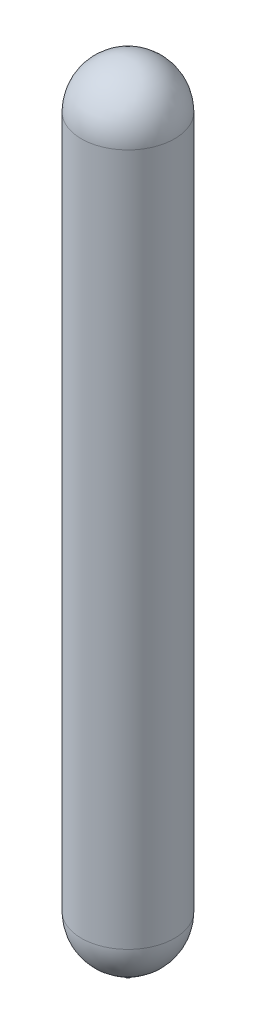
ISO-10303-21;
HEADER;
FILE_DESCRIPTION(('STEP AP214'),'2;1');
FILE_NAME('part.step','',(''),(''),'','','');
FILE_SCHEMA(('AUTOMOTIVE_DESIGN { 1 0 10303 214 1 1 1 1 }'));
ENDSEC;
DATA;
#1=APPLICATION_CONTEXT('core data for automotive mechanical design processes');
#2=APPLICATION_PROTOCOL_DEFINITION('international standard','automotive_design',2000,#1);
#3=PRODUCT_CONTEXT('',#1,'mechanical');
#4=PRODUCT('Part','Part','',(#3));
#5=PRODUCT_RELATED_PRODUCT_CATEGORY('part','',(#4));
#6=PRODUCT_DEFINITION_FORMATION('','',#4);
#7=PRODUCT_DEFINITION_CONTEXT('part definition',#1,'design');
#8=PRODUCT_DEFINITION('design','',#6,#7);
#9=PRODUCT_DEFINITION_SHAPE('','',#8);
#10=(LENGTH_UNIT() NAMED_UNIT(*) SI_UNIT(.MILLI.,.METRE.));
#11=(NAMED_UNIT(*) PLANE_ANGLE_UNIT() SI_UNIT($,.RADIAN.));
#12=(NAMED_UNIT(*) SI_UNIT($,.STERADIAN.) SOLID_ANGLE_UNIT());
#13=UNCERTAINTY_MEASURE_WITH_UNIT(LENGTH_MEASURE(1.E-05),#10,'distance_accuracy_value','');
#14=(GEOMETRIC_REPRESENTATION_CONTEXT(3) GLOBAL_UNCERTAINTY_ASSIGNED_CONTEXT((#13)) GLOBAL_UNIT_ASSIGNED_CONTEXT((#10,
#11,#12)) REPRESENTATION_CONTEXT('',''));
#15=CARTESIAN_POINT('',(0.,0.,0.));
#16=DIRECTION('',(0.,0.,1.));
#17=DIRECTION('',(1.,0.,0.));
#18=AXIS2_PLACEMENT_3D('',#15,#16,#17);
#19=CARTESIAN_POINT('',(0.,50.3580155806544,0.));
#20=DIRECTION('',(0.,1.,0.));
#21=DIRECTION('',(-1.,0.,0.));
#22=AXIS2_PLACEMENT_3D('',#19,#20,#21);
#23=CYLINDRICAL_SURFACE('',#22,142.2146);
#24=CARTESIAN_POINT('',(-2.52480794608641E-13,2112.02016,0.));
#25=DIRECTION('',(0.,1.,0.));
#26=DIRECTION('',(-1.,0.,0.));
#27=AXIS2_PLACEMENT_3D('',#24,#25,#26);
#28=CIRCLE('',#27,142.2146);
#29=CARTESIAN_POINT('',(-142.2146,2112.02016,0.));
#30=VERTEX_POINT('',#29);
#31=EDGE_CURVE('E68',#30,#30,#28,.T.);
#32=ORIENTED_EDGE('',*,*,#31,.F.);
#33=EDGE_LOOP('',(#32));
#34=FACE_BOUND('',#33,.T.);
#35=CARTESIAN_POINT('',(0.,0.,0.));
#36=DIRECTION('',(0.,1.,0.));
#37=DIRECTION('',(-1.,0.,0.));
#38=AXIS2_PLACEMENT_3D('',#35,#36,#37);
#39=CIRCLE('',#38,142.2146);
#40=CARTESIAN_POINT('',(-142.2146,0.,0.));
#41=VERTEX_POINT('',#40);
#42=EDGE_CURVE('E11',#41,#41,#39,.T.);
#43=ORIENTED_EDGE('',*,*,#42,.T.);
#44=EDGE_LOOP('',(#43));
#45=FACE_BOUND('',#44,.T.);
#46=ADVANCED_FACE('F46',(#34,#45),#23,.T.);
#47=CARTESIAN_POINT('',(0.,0.,0.));
#48=DIRECTION('',(0.,1.,0.));
#49=DIRECTION('',(-1.,0.,0.));
#50=AXIS2_PLACEMENT_3D('',#47,#48,#49);
#51=SPHERICAL_SURFACE('',#50,142.2146);
#52=CARTESIAN_POINT('',(0.,-141.646399365321,0.));
#53=DIRECTION('',(0.,1.,0.));
#54=DIRECTION('',(-1.,0.,0.));
#55=AXIS2_PLACEMENT_3D('',#52,#53,#54);
#56=CIRCLE('',#55,12.7);
#57=CARTESIAN_POINT('',(-12.7,-141.646399365321,0.));
#58=VERTEX_POINT('',#57);
#59=EDGE_CURVE('E52',#58,#58,#56,.T.);
#60=ORIENTED_EDGE('',*,*,#59,.T.);
#61=EDGE_LOOP('',(#60));
#62=FACE_BOUND('',#61,.T.);
#63=ORIENTED_EDGE('',*,*,#42,.F.);
#64=EDGE_LOOP('',(#63));
#65=FACE_BOUND('',#64,.T.);
#66=ADVANCED_FACE('F75',(#62,#65),#51,.T.);
#67=CARTESIAN_POINT('',(0.,50.3580155806544,0.));
#68=DIRECTION('',(0.,1.,0.));
#69=DIRECTION('',(-1.,0.,0.));
#70=AXIS2_PLACEMENT_3D('',#67,#68,#69);
#71=CYLINDRICAL_SURFACE('',#70,12.7);
#72=CARTESIAN_POINT('',(0.,-138.305330063017,0.));
#73=DIRECTION('',(0.,1.,0.));
#74=DIRECTION('',(-1.,0.,0.));
#75=AXIS2_PLACEMENT_3D('',#72,#73,#74);
#76=CIRCLE('',#75,12.7);
#77=CARTESIAN_POINT('',(-12.7,-138.305330063017,0.));
#78=VERTEX_POINT('',#77);
#79=EDGE_CURVE('E56',#78,#78,#76,.T.);
#80=ORIENTED_EDGE('',*,*,#79,.T.);
#81=EDGE_LOOP('',(#80));
#82=FACE_BOUND('',#81,.T.);
#83=ORIENTED_EDGE('',*,*,#59,.F.);
#84=EDGE_LOOP('',(#83));
#85=FACE_BOUND('',#84,.T.);
#86=ADVANCED_FACE('F79',(#82,#85),#71,.F.);
#87=CARTESIAN_POINT('',(0.,0.,0.));
#88=DIRECTION('',(0.,1.,0.));
#89=DIRECTION('',(-1.,0.,0.));
#90=AXIS2_PLACEMENT_3D('',#87,#88,#89);
#91=SPHERICAL_SURFACE('',#90,138.8872);
#92=ORIENTED_EDGE('',*,*,#79,.F.);
#93=EDGE_LOOP('',(#92));
#94=FACE_BOUND('',#93,.T.);
#95=CARTESIAN_POINT('',(0.,0.,0.));
#96=DIRECTION('',(0.,1.,0.));
#97=DIRECTION('',(-1.,0.,0.));
#98=AXIS2_PLACEMENT_3D('',#95,#96,#97);
#99=CIRCLE('',#98,138.8872);
#100=CARTESIAN_POINT('',(-138.8872,0.,0.));
#101=VERTEX_POINT('',#100);
#102=EDGE_CURVE('E60',#101,#101,#99,.T.);
#103=ORIENTED_EDGE('',*,*,#102,.T.);
#104=EDGE_LOOP('',(#103));
#105=FACE_BOUND('',#104,.T.);
#106=ADVANCED_FACE('F83',(#94,#105),#91,.F.);
#107=CARTESIAN_POINT('',(0.,50.3580155806544,0.));
#108=DIRECTION('',(0.,1.,0.));
#109=DIRECTION('',(-1.,0.,0.));
#110=AXIS2_PLACEMENT_3D('',#107,#108,#109);
#111=CYLINDRICAL_SURFACE('',#110,138.8872);
#112=ORIENTED_EDGE('',*,*,#102,.F.);
#113=EDGE_LOOP('',(#112));
#114=FACE_BOUND('',#113,.T.);
#115=CARTESIAN_POINT('',(-2.52480794608641E-13,2112.02016,0.));
#116=DIRECTION('',(0.,1.,0.));
#117=DIRECTION('',(-1.,0.,0.));
#118=AXIS2_PLACEMENT_3D('',#115,#116,#117);
#119=CIRCLE('',#118,138.8872);
#120=CARTESIAN_POINT('',(-138.8872,2112.02016,0.));
#121=VERTEX_POINT('',#120);
#122=EDGE_CURVE('E65',#121,#121,#119,.T.);
#123=ORIENTED_EDGE('',*,*,#122,.T.);
#124=EDGE_LOOP('',(#123));
#125=FACE_BOUND('',#124,.T.);
#126=ADVANCED_FACE('F90',(#114,#125),#111,.F.);
#127=CARTESIAN_POINT('',(-2.4980018054066E-13,2112.02016,0.));
#128=DIRECTION('',(0.,1.,0.));
#129=DIRECTION('',(-1.,0.,0.));
#130=AXIS2_PLACEMENT_3D('',#127,#128,#129);
#131=SPHERICAL_SURFACE('',#130,138.887199999999);
#132=ORIENTED_EDGE('',*,*,#122,.F.);
#133=EDGE_LOOP('',(#132));
#134=FACE_BOUND('',#133,.T.);
#135=ADVANCED_FACE('F94',(#134),#131,.F.);
#136=CARTESIAN_POINT('',(-2.4980018054066E-13,2112.02016,0.));
#137=DIRECTION('',(0.,1.,0.));
#138=DIRECTION('',(-1.,0.,0.));
#139=AXIS2_PLACEMENT_3D('',#136,#137,#138);
#140=SPHERICAL_SURFACE('',#139,142.2146);
#141=ORIENTED_EDGE('',*,*,#31,.T.);
#142=EDGE_LOOP('',(#141));
#143=FACE_BOUND('',#142,.T.);
#144=ADVANCED_FACE('F72',(#143),#140,.T.);
#145=CLOSED_SHELL('',(#46,#66,#86,#106,#126,#135,#144));
#146=MANIFOLD_SOLID_BREP('B2',#145);
#147=CARTESIAN_POINT('',(0.,50.3580155806544,0.));
#148=DIRECTION('',(0.,1.,0.));
#149=DIRECTION('',(-1.,0.,0.));
#150=AXIS2_PLACEMENT_3D('',#147,#148,#149);
#151=CYLINDRICAL_SURFACE('',#150,138.8872);
#152=CARTESIAN_POINT('',(0.,0.,0.));
#153=DIRECTION('',(0.,1.,0.));
#154=DIRECTION('',(-1.,0.,0.));
#155=AXIS2_PLACEMENT_3D('',#152,#153,#154);
#156=CIRCLE('',#155,138.8872);
#157=CARTESIAN_POINT('',(-138.8872,0.,0.));
#158=VERTEX_POINT('',#157);
#159=EDGE_CURVE('E45',#158,#158,#156,.T.);
#160=ORIENTED_EDGE('',*,*,#159,.T.);
#161=EDGE_LOOP('',(#160));
#162=FACE_BOUND('',#161,.T.);
#163=CARTESIAN_POINT('',(-2.52480794608641E-13,2112.02016,0.));
#164=DIRECTION('',(0.,1.,0.));
#165=DIRECTION('',(-1.,0.,0.));
#166=AXIS2_PLACEMENT_3D('',#163,#164,#165);
#167=CIRCLE('',#166,138.8872);
#168=CARTESIAN_POINT('',(-138.8872,2112.02016,0.));
#169=VERTEX_POINT('',#168);
#170=EDGE_CURVE('E174',#169,#169,#167,.T.);
#171=ORIENTED_EDGE('',*,*,#170,.F.);
#172=EDGE_LOOP('',(#171));
#173=FACE_BOUND('',#172,.T.);
#174=ADVANCED_FACE('F146',(#162,#173),#151,.T.);
#175=CARTESIAN_POINT('',(0.,0.,0.));
#176=DIRECTION('',(0.,1.,0.));
#177=DIRECTION('',(-1.,0.,0.));
#178=AXIS2_PLACEMENT_3D('',#175,#176,#177);
#179=SPHERICAL_SURFACE('',#178,138.8872);
#180=CARTESIAN_POINT('',(0.,-138.305330063017,0.));
#181=DIRECTION('',(0.,1.,0.));
#182=DIRECTION('',(-1.,0.,0.));
#183=AXIS2_PLACEMENT_3D('',#180,#181,#182);
#184=CIRCLE('',#183,12.7);
#185=CARTESIAN_POINT('',(-12.7,-138.305330063017,0.));
#186=VERTEX_POINT('',#185);
#187=EDGE_CURVE('E152',#186,#186,#184,.T.);
#188=ORIENTED_EDGE('',*,*,#187,.T.);
#189=EDGE_LOOP('',(#188));
#190=FACE_BOUND('',#189,.T.);
#191=ORIENTED_EDGE('',*,*,#159,.F.);
#192=EDGE_LOOP('',(#191));
#193=FACE_BOUND('',#192,.T.);
#194=ADVANCED_FACE('F181',(#190,#193),#179,.T.);
#195=CARTESIAN_POINT('',(0.,50.3580155806544,0.));
#196=DIRECTION('',(0.,1.,0.));
#197=DIRECTION('',(-1.,0.,0.));
#198=AXIS2_PLACEMENT_3D('',#195,#196,#197);
#199=CYLINDRICAL_SURFACE('',#198,12.7);
#200=ORIENTED_EDGE('',*,*,#187,.F.);
#201=EDGE_LOOP('',(#200));
#202=FACE_BOUND('',#201,.T.);
#203=CARTESIAN_POINT('',(0.,-167.046399365321,0.));
#204=DIRECTION('',(0.,1.,0.));
#205=DIRECTION('',(-1.,0.,0.));
#206=AXIS2_PLACEMENT_3D('',#203,#204,#205);
#207=CIRCLE('',#206,12.7);
#208=CARTESIAN_POINT('',(-12.7,-167.046399365321,0.));
#209=VERTEX_POINT('',#208);
#210=EDGE_CURVE('E156',#209,#209,#207,.T.);
#211=ORIENTED_EDGE('',*,*,#210,.T.);
#212=EDGE_LOOP('',(#211));
#213=FACE_BOUND('',#212,.T.);
#214=ADVANCED_FACE('F185',(#202,#213),#199,.T.);
#215=CARTESIAN_POINT('',(0.,-167.046399365321,0.));
#216=DIRECTION('',(0.,1.,0.));
#217=DIRECTION('',(-1.,0.,0.));
#218=AXIS2_PLACEMENT_3D('',#215,#216,#217);
#219=PLANE('',#218);
#220=ORIENTED_EDGE('',*,*,#210,.F.);
#221=EDGE_LOOP('',(#220));
#222=FACE_BOUND('',#221,.T.);
#223=CARTESIAN_POINT('',(0.,-167.046399365321,0.));
#224=DIRECTION('',(0.,1.,0.));
#225=DIRECTION('',(-1.,0.,0.));
#226=AXIS2_PLACEMENT_3D('',#223,#224,#225);
#227=CIRCLE('',#226,3.175);
#228=CARTESIAN_POINT('',(-3.17499999999997,-167.046399365321,0.));
#229=VERTEX_POINT('',#228);
#230=EDGE_CURVE('E160',#229,#229,#227,.T.);
#231=ORIENTED_EDGE('',*,*,#230,.T.);
#232=EDGE_LOOP('',(#231));
#233=FACE_BOUND('',#232,.T.);
#234=ADVANCED_FACE('F189',(#222,#233),#219,.F.);
#235=CARTESIAN_POINT('',(0.,50.3580155806544,0.));
#236=DIRECTION('',(0.,1.,0.));
#237=DIRECTION('',(-1.,0.,0.));
#238=AXIS2_PLACEMENT_3D('',#235,#236,#237);
#239=CYLINDRICAL_SURFACE('',#238,3.175);
#240=ORIENTED_EDGE('',*,*,#230,.F.);
#241=EDGE_LOOP('',(#240));
#242=FACE_BOUND('',#241,.T.);
#243=CARTESIAN_POINT('',(0.,-117.000128381297,0.));
#244=DIRECTION('',(0.,1.,0.));
#245=DIRECTION('',(-1.,0.,0.));
#246=AXIS2_PLACEMENT_3D('',#243,#244,#245);
#247=CIRCLE('',#246,3.175);
#248=CARTESIAN_POINT('',(-3.17499999999998,-117.000128381297,0.));
#249=VERTEX_POINT('',#248);
#250=EDGE_CURVE('E165',#249,#249,#247,.T.);
#251=ORIENTED_EDGE('',*,*,#250,.T.);
#252=EDGE_LOOP('',(#251));
#253=FACE_BOUND('',#252,.T.);
#254=ADVANCED_FACE('F196',(#242,#253),#239,.F.);
#255=CARTESIAN_POINT('',(0.,0.,0.));
#256=DIRECTION('',(0.,1.,0.));
#257=DIRECTION('',(-1.,0.,0.));
#258=AXIS2_PLACEMENT_3D('',#255,#256,#257);
#259=SPHERICAL_SURFACE('',#258,117.0432);
#260=ORIENTED_EDGE('',*,*,#250,.F.);
#261=EDGE_LOOP('',(#260));
#262=FACE_BOUND('',#261,.T.);
#263=CARTESIAN_POINT('',(0.,0.,0.));
#264=DIRECTION('',(0.,1.,0.));
#265=DIRECTION('',(-1.,0.,0.));
#266=AXIS2_PLACEMENT_3D('',#263,#264,#265);
#267=CIRCLE('',#266,117.0432);
#268=CARTESIAN_POINT('',(-117.0432,0.,0.));
#269=VERTEX_POINT('',#268);
#270=EDGE_CURVE('E168',#269,#269,#267,.T.);
#271=ORIENTED_EDGE('',*,*,#270,.T.);
#272=EDGE_LOOP('',(#271));
#273=FACE_BOUND('',#272,.T.);
#274=ADVANCED_FACE('F200',(#262,#273),#259,.F.);
#275=CARTESIAN_POINT('',(0.,50.3580155806544,0.));
#276=DIRECTION('',(0.,1.,0.));
#277=DIRECTION('',(-1.,0.,0.));
#278=AXIS2_PLACEMENT_3D('',#275,#276,#277);
#279=CYLINDRICAL_SURFACE('',#278,117.0432);
#280=ORIENTED_EDGE('',*,*,#270,.F.);
#281=EDGE_LOOP('',(#280));
#282=FACE_BOUND('',#281,.T.);
#283=CARTESIAN_POINT('',(-2.52480794608641E-13,2112.02016,0.));
#284=DIRECTION('',(0.,1.,0.));
#285=DIRECTION('',(-1.,0.,0.));
#286=AXIS2_PLACEMENT_3D('',#283,#284,#285);
#287=CIRCLE('',#286,117.0432);
#288=CARTESIAN_POINT('',(-117.0432,2112.02016,0.));
#289=VERTEX_POINT('',#288);
#290=EDGE_CURVE('E171',#289,#289,#287,.T.);
#291=ORIENTED_EDGE('',*,*,#290,.T.);
#292=EDGE_LOOP('',(#291));
#293=FACE_BOUND('',#292,.T.);
#294=ADVANCED_FACE('F204',(#282,#293),#279,.F.);
#295=CARTESIAN_POINT('',(-2.4980018054066E-13,2112.02016,0.));
#296=DIRECTION('',(0.,1.,0.));
#297=DIRECTION('',(-1.,0.,0.));
#298=AXIS2_PLACEMENT_3D('',#295,#296,#297);
#299=SPHERICAL_SURFACE('',#298,117.0432);
#300=ORIENTED_EDGE('',*,*,#290,.F.);
#301=EDGE_LOOP('',(#300));
#302=FACE_BOUND('',#301,.T.);
#303=ADVANCED_FACE('F208',(#302),#299,.F.);
#304=CARTESIAN_POINT('',(-2.4980018054066E-13,2112.02016,0.));
#305=DIRECTION('',(0.,1.,0.));
#306=DIRECTION('',(-1.,0.,0.));
#307=AXIS2_PLACEMENT_3D('',#304,#305,#306);
#308=SPHERICAL_SURFACE('',#307,138.887199999999);
#309=ORIENTED_EDGE('',*,*,#170,.T.);
#310=EDGE_LOOP('',(#309));
#311=FACE_BOUND('',#310,.T.);
#312=ADVANCED_FACE('F178',(#311),#308,.T.);
#313=CLOSED_SHELL('',(#174,#194,#214,#234,#254,#274,#294,#303,#312));
#314=MANIFOLD_SOLID_BREP('B6',#313);
#315=ADVANCED_BREP_SHAPE_REPRESENTATION('',(#18,#146,#314),#14);
#316=SHAPE_DEFINITION_REPRESENTATION(#9,#315);
ENDSEC;
END-ISO-10303-21;
